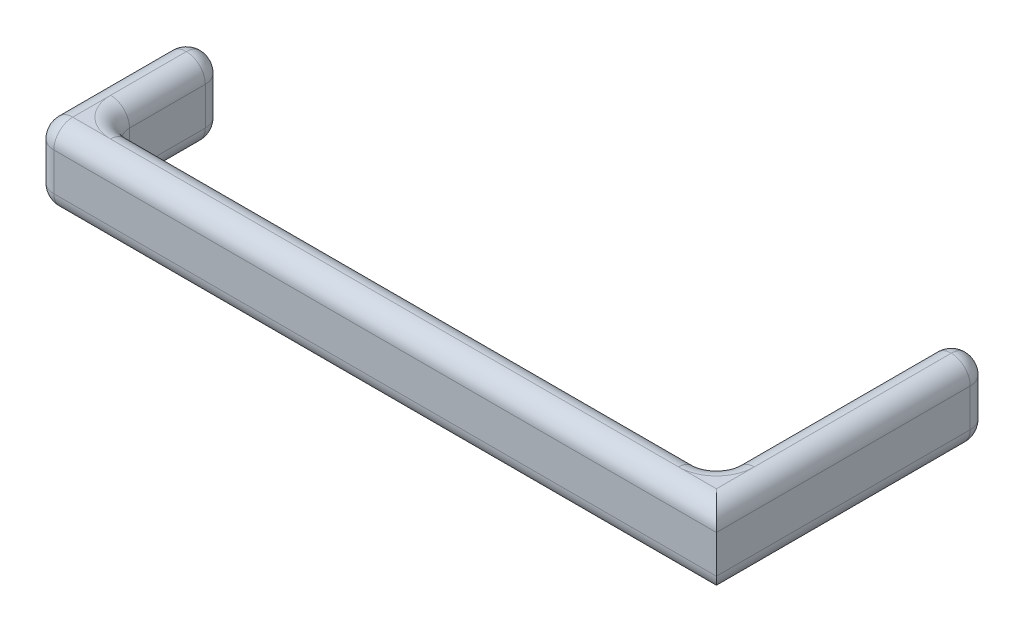
ISO-10303-21;
HEADER;
FILE_DESCRIPTION(('STEP AP214'),'2;1');
FILE_NAME('part.step','',(''),(''),'','','');
FILE_SCHEMA(('AUTOMOTIVE_DESIGN { 1 0 10303 214 1 1 1 1 }'));
ENDSEC;
DATA;
#1=APPLICATION_CONTEXT('core data for automotive mechanical design processes');
#2=APPLICATION_PROTOCOL_DEFINITION('international standard','automotive_design',2000,#1);
#3=PRODUCT_CONTEXT('',#1,'mechanical');
#4=PRODUCT('Part','Part','',(#3));
#5=PRODUCT_RELATED_PRODUCT_CATEGORY('part','',(#4));
#6=PRODUCT_DEFINITION_FORMATION('','',#4);
#7=PRODUCT_DEFINITION_CONTEXT('part definition',#1,'design');
#8=PRODUCT_DEFINITION('design','',#6,#7);
#9=PRODUCT_DEFINITION_SHAPE('','',#8);
#10=(LENGTH_UNIT() NAMED_UNIT(*) SI_UNIT(.MILLI.,.METRE.));
#11=(NAMED_UNIT(*) PLANE_ANGLE_UNIT() SI_UNIT($,.RADIAN.));
#12=(NAMED_UNIT(*) SI_UNIT($,.STERADIAN.) SOLID_ANGLE_UNIT());
#13=UNCERTAINTY_MEASURE_WITH_UNIT(LENGTH_MEASURE(1.E-05),#10,'distance_accuracy_value','');
#14=(GEOMETRIC_REPRESENTATION_CONTEXT(3) GLOBAL_UNCERTAINTY_ASSIGNED_CONTEXT((#13)) GLOBAL_UNIT_ASSIGNED_CONTEXT((#10,
#11,#12)) REPRESENTATION_CONTEXT('',''));
#15=CARTESIAN_POINT('',(0.,0.,0.));
#16=DIRECTION('',(0.,0.,1.));
#17=DIRECTION('',(1.,0.,0.));
#18=AXIS2_PLACEMENT_3D('',#15,#16,#17);
#19=CARTESIAN_POINT('',(0.,101.6,50.8));
#20=DIRECTION('',(0.,-1.,0.));
#21=DIRECTION('',(1.,0.,0.));
#22=AXIS2_PLACEMENT_3D('',#19,#20,#21);
#23=PLANE('',#22);
#24=CARTESIAN_POINT('',(-25.4,101.6,-25.4));
#25=DIRECTION('',(0.,-1.,0.));
#26=DIRECTION('',(1.,0.,0.));
#27=AXIS2_PLACEMENT_3D('',#24,#25,#26);
#28=CIRCLE('',#27,50.8);
#29=CARTESIAN_POINT('',(-25.4,101.6,25.4));
#30=VERTEX_POINT('',#29);
#31=CARTESIAN_POINT('',(25.4,101.6,-25.4));
#32=VERTEX_POINT('',#31);
#33=EDGE_CURVE('E11',#30,#32,#28,.F.);
#34=ORIENTED_EDGE('',*,*,#33,.F.);
#35=DIRECTION('',(-1.,0.,0.));
#36=VECTOR('',#35,1.);
#37=CARTESIAN_POINT('',(50.8,101.6,25.4));
#38=LINE('',#37,#36);
#39=CARTESIAN_POINT('',(25.4,101.6,25.4));
#40=VERTEX_POINT('',#39);
#41=EDGE_CURVE('E194',#30,#40,#38,.F.);
#42=ORIENTED_EDGE('',*,*,#41,.T.);
#43=DIRECTION('',(0.,0.,1.));
#44=VECTOR('',#43,1.);
#45=CARTESIAN_POINT('',(25.4,101.6,-315.087));
#46=LINE('',#45,#44);
#47=EDGE_CURVE('E48',#40,#32,#46,.F.);
#48=ORIENTED_EDGE('',*,*,#47,.T.);
#49=EDGE_LOOP('',(#34,#42,#48));
#50=FACE_BOUND('',#49,.T.);
#51=ADVANCED_FACE('F38',(#50),#23,.F.);
#52=CARTESIAN_POINT('',(-787.4,101.6,-25.4));
#53=DIRECTION('',(0.,-1.,0.));
#54=DIRECTION('',(1.,0.,0.));
#55=AXIS2_PLACEMENT_3D('',#52,#53,#54);
#56=CIRCLE('',#55,50.8);
#57=CARTESIAN_POINT('',(-838.2,101.6,-25.4));
#58=VERTEX_POINT('',#57);
#59=CARTESIAN_POINT('',(-787.4,101.6,25.4));
#60=VERTEX_POINT('',#59);
#61=EDGE_CURVE('E203',#58,#60,#56,.F.);
#62=ORIENTED_EDGE('',*,*,#61,.F.);
#63=DIRECTION('',(0.,0.,1.));
#64=VECTOR('',#63,1.);
#65=CARTESIAN_POINT('',(-838.2,101.6,50.8));
#66=LINE('',#65,#64);
#67=CARTESIAN_POINT('',(-838.2,101.6,25.4));
#68=VERTEX_POINT('',#67);
#69=EDGE_CURVE('E443',#58,#68,#66,.T.);
#70=ORIENTED_EDGE('',*,*,#69,.T.);
#71=DIRECTION('',(-1.,0.,0.));
#72=VECTOR('',#71,1.);
#73=CARTESIAN_POINT('',(50.8,101.6,25.4));
#74=LINE('',#73,#72);
#75=EDGE_CURVE('E445',#68,#60,#74,.F.);
#76=ORIENTED_EDGE('',*,*,#75,.T.);
#77=EDGE_LOOP('',(#62,#70,#76));
#78=FACE_BOUND('',#77,.T.);
#79=ADVANCED_FACE('F226',(#78),#23,.F.);
#80=CARTESIAN_POINT('',(0.,0.,50.8));
#81=DIRECTION('',(0.,1.,0.));
#82=DIRECTION('',(-1.,0.,0.));
#83=AXIS2_PLACEMENT_3D('',#80,#81,#82);
#84=PLANE('',#83);
#85=DIRECTION('',(0.,0.,1.));
#86=VECTOR('',#85,1.);
#87=CARTESIAN_POINT('',(25.4,0.,50.8));
#88=LINE('',#87,#86);
#89=CARTESIAN_POINT('',(25.4,0.,-25.4));
#90=VERTEX_POINT('',#89);
#91=CARTESIAN_POINT('',(25.4,0.,25.4));
#92=VERTEX_POINT('',#91);
#93=EDGE_CURVE('E398',#90,#92,#88,.T.);
#94=ORIENTED_EDGE('',*,*,#93,.T.);
#95=DIRECTION('',(1.,0.,0.));
#96=VECTOR('',#95,1.);
#97=CARTESIAN_POINT('',(-863.6,-1.05760497574365E-13,25.4));
#98=LINE('',#97,#96);
#99=CARTESIAN_POINT('',(-25.4,0.,25.4));
#100=VERTEX_POINT('',#99);
#101=EDGE_CURVE('E400',#92,#100,#98,.F.);
#102=ORIENTED_EDGE('',*,*,#101,.T.);
#103=CARTESIAN_POINT('',(-25.4,0.,-25.4));
#104=DIRECTION('',(0.,1.,0.));
#105=DIRECTION('',(-1.,0.,0.));
#106=AXIS2_PLACEMENT_3D('',#103,#104,#105);
#107=CIRCLE('',#106,50.8);
#108=EDGE_CURVE('E395',#90,#100,#107,.F.);
#109=ORIENTED_EDGE('',*,*,#108,.F.);
#110=EDGE_LOOP('',(#94,#102,#109));
#111=FACE_BOUND('',#110,.T.);
#112=ADVANCED_FACE('F231',(#111),#84,.F.);
#113=CARTESIAN_POINT('',(-787.4,0.,-25.4));
#114=DIRECTION('',(0.,1.,0.));
#115=DIRECTION('',(-1.,0.,0.));
#116=AXIS2_PLACEMENT_3D('',#113,#114,#115);
#117=CIRCLE('',#116,50.8);
#118=CARTESIAN_POINT('',(-787.4,0.,25.4));
#119=VERTEX_POINT('',#118);
#120=CARTESIAN_POINT('',(-838.2,-1.02649894704531E-13,-25.4));
#121=VERTEX_POINT('',#120);
#122=EDGE_CURVE('E387',#119,#121,#117,.F.);
#123=ORIENTED_EDGE('',*,*,#122,.F.);
#124=DIRECTION('',(1.,0.,0.));
#125=VECTOR('',#124,1.);
#126=CARTESIAN_POINT('',(-863.6,-1.05760497574365E-13,25.4));
#127=LINE('',#126,#125);
#128=CARTESIAN_POINT('',(-838.2,-1.02649894704531E-13,25.4));
#129=VERTEX_POINT('',#128);
#130=EDGE_CURVE('E392',#119,#129,#127,.F.);
#131=ORIENTED_EDGE('',*,*,#130,.T.);
#132=DIRECTION('',(0.,0.,1.));
#133=VECTOR('',#132,1.);
#134=CARTESIAN_POINT('',(-838.2,-1.02649894704531E-13,-152.4));
#135=LINE('',#134,#133);
#136=EDGE_CURVE('E390',#129,#121,#135,.F.);
#137=ORIENTED_EDGE('',*,*,#136,.T.);
#138=EDGE_LOOP('',(#123,#131,#137));
#139=FACE_BOUND('',#138,.T.);
#140=ADVANCED_FACE('F235',(#139),#84,.F.);
#141=CARTESIAN_POINT('',(0.,0.,50.8));
#142=DIRECTION('',(0.,0.,1.));
#143=DIRECTION('',(1.,0.,0.));
#144=AXIS2_PLACEMENT_3D('',#141,#142,#143);
#145=PLANE('',#144);
#146=DIRECTION('',(0.,-1.,0.));
#147=VECTOR('',#146,1.);
#148=CARTESIAN_POINT('',(-838.2,0.,50.8));
#149=LINE('',#148,#147);
#150=CARTESIAN_POINT('',(-838.2,76.1999999999999,50.8));
#151=VERTEX_POINT('',#150);
#152=CARTESIAN_POINT('',(-838.2,25.3999999999999,50.8));
#153=VERTEX_POINT('',#152);
#154=EDGE_CURVE('E381',#151,#153,#149,.T.);
#155=ORIENTED_EDGE('',*,*,#154,.T.);
#156=DIRECTION('',(1.,0.,0.));
#157=VECTOR('',#156,1.);
#158=CARTESIAN_POINT('',(50.8,25.4,50.8));
#159=LINE('',#158,#157);
#160=CARTESIAN_POINT('',(50.8,25.4,50.8));
#161=VERTEX_POINT('',#160);
#162=EDGE_CURVE('E385',#153,#161,#159,.T.);
#163=ORIENTED_EDGE('',*,*,#162,.T.);
#164=DIRECTION('',(0.,1.,0.));
#165=VECTOR('',#164,1.);
#166=CARTESIAN_POINT('',(50.8,101.6,50.8));
#167=LINE('',#166,#165);
#168=CARTESIAN_POINT('',(50.8,76.2,50.8));
#169=VERTEX_POINT('',#168);
#170=EDGE_CURVE('E372',#161,#169,#167,.T.);
#171=ORIENTED_EDGE('',*,*,#170,.T.);
#172=DIRECTION('',(-1.,0.,0.));
#173=VECTOR('',#172,1.);
#174=CARTESIAN_POINT('',(-863.6,76.1999999999999,50.8));
#175=LINE('',#174,#173);
#176=EDGE_CURVE('E376',#169,#151,#175,.T.);
#177=ORIENTED_EDGE('',*,*,#176,.T.);
#178=EDGE_LOOP('',(#155,#163,#171,#177));
#179=FACE_BOUND('',#178,.T.);
#180=ADVANCED_FACE('F578',(#179),#145,.T.);
#181=CARTESIAN_POINT('',(0.,0.,0.));
#182=DIRECTION('',(0.,0.,1.));
#183=DIRECTION('',(1.,0.,0.));
#184=AXIS2_PLACEMENT_3D('',#181,#182,#183);
#185=PLANE('',#184);
#186=DIRECTION('',(0.,1.,0.));
#187=VECTOR('',#186,1.);
#188=CARTESIAN_POINT('',(-25.4,0.,0.));
#189=LINE('',#188,#187);
#190=CARTESIAN_POINT('',(-25.4,76.2,0.));
#191=VERTEX_POINT('',#190);
#192=CARTESIAN_POINT('',(-25.4,25.4,0.));
#193=VERTEX_POINT('',#192);
#194=EDGE_CURVE('E413',#191,#193,#189,.F.);
#195=ORIENTED_EDGE('',*,*,#194,.T.);
#196=DIRECTION('',(1.,0.,0.));
#197=VECTOR('',#196,1.);
#198=CARTESIAN_POINT('',(0.,25.4,0.));
#199=LINE('',#198,#197);
#200=CARTESIAN_POINT('',(-787.4,25.3999999999999,0.));
#201=VERTEX_POINT('',#200);
#202=EDGE_CURVE('E415',#193,#201,#199,.F.);
#203=ORIENTED_EDGE('',*,*,#202,.T.);
#204=DIRECTION('',(0.,-1.,0.));
#205=VECTOR('',#204,1.);
#206=CARTESIAN_POINT('',(-787.4,0.,0.));
#207=LINE('',#206,#205);
#208=CARTESIAN_POINT('',(-787.4,76.1999999999999,0.));
#209=VERTEX_POINT('',#208);
#210=EDGE_CURVE('E411',#201,#209,#207,.F.);
#211=ORIENTED_EDGE('',*,*,#210,.T.);
#212=DIRECTION('',(-1.,0.,0.));
#213=VECTOR('',#212,1.);
#214=CARTESIAN_POINT('',(0.,76.2,0.));
#215=LINE('',#214,#213);
#216=EDGE_CURVE('E409',#209,#191,#215,.F.);
#217=ORIENTED_EDGE('',*,*,#216,.T.);
#218=EDGE_LOOP('',(#195,#203,#211,#217));
#219=FACE_BOUND('',#218,.T.);
#220=ADVANCED_FACE('F603',(#219),#185,.F.);
#221=CARTESIAN_POINT('',(-812.8,0.,-152.4));
#222=DIRECTION('',(1.,0.,0.));
#223=DIRECTION('',(0.,0.,-1.));
#224=AXIS2_PLACEMENT_3D('',#221,#222,#223);
#225=PLANE('',#224);
#226=DIRECTION('',(0.,0.,1.));
#227=VECTOR('',#226,1.);
#228=CARTESIAN_POINT('',(-812.8,25.3999999999999,-152.4));
#229=LINE('',#228,#227);
#230=CARTESIAN_POINT('',(-812.8,25.3999999999999,-25.4));
#231=VERTEX_POINT('',#230);
#232=CARTESIAN_POINT('',(-812.8,25.3999999999999,-127.));
#233=VERTEX_POINT('',#232);
#234=EDGE_CURVE('E439',#231,#233,#229,.F.);
#235=ORIENTED_EDGE('',*,*,#234,.T.);
#236=DIRECTION('',(0.,1.,0.));
#237=VECTOR('',#236,1.);
#238=CARTESIAN_POINT('',(-812.8,101.6,-127.));
#239=LINE('',#238,#237);
#240=CARTESIAN_POINT('',(-812.8,76.1999999999999,-127.));
#241=VERTEX_POINT('',#240);
#242=EDGE_CURVE('E441',#233,#241,#239,.T.);
#243=ORIENTED_EDGE('',*,*,#242,.T.);
#244=DIRECTION('',(0.,0.,1.));
#245=VECTOR('',#244,1.);
#246=CARTESIAN_POINT('',(-812.8,76.1999999999999,0.));
#247=LINE('',#246,#245);
#248=CARTESIAN_POINT('',(-812.8,76.1999999999999,-25.4));
#249=VERTEX_POINT('',#248);
#250=EDGE_CURVE('E435',#241,#249,#247,.T.);
#251=ORIENTED_EDGE('',*,*,#250,.T.);
#252=DIRECTION('',(0.,-1.,0.));
#253=VECTOR('',#252,1.);
#254=CARTESIAN_POINT('',(-812.8,0.,-25.4));
#255=LINE('',#254,#253);
#256=EDGE_CURVE('E437',#249,#231,#255,.T.);
#257=ORIENTED_EDGE('',*,*,#256,.T.);
#258=EDGE_LOOP('',(#235,#243,#251,#257));
#259=FACE_BOUND('',#258,.T.);
#260=ADVANCED_FACE('F560',(#259),#225,.T.);
#261=CARTESIAN_POINT('',(-863.6,0.,-152.4));
#262=DIRECTION('',(-1.,0.,0.));
#263=DIRECTION('',(0.,0.,1.));
#264=AXIS2_PLACEMENT_3D('',#261,#262,#263);
#265=PLANE('',#264);
#266=DIRECTION('',(0.,-1.,0.));
#267=VECTOR('',#266,1.);
#268=CARTESIAN_POINT('',(-863.6,0.,-127.));
#269=LINE('',#268,#267);
#270=CARTESIAN_POINT('',(-863.6,76.1999999999999,-127.));
#271=VERTEX_POINT('',#270);
#272=CARTESIAN_POINT('',(-863.6,25.3999999999999,-127.));
#273=VERTEX_POINT('',#272);
#274=EDGE_CURVE('E420',#271,#273,#269,.T.);
#275=ORIENTED_EDGE('',*,*,#274,.T.);
#276=DIRECTION('',(0.,0.,1.));
#277=VECTOR('',#276,1.);
#278=CARTESIAN_POINT('',(-863.6,25.3999999999999,50.8));
#279=LINE('',#278,#277);
#280=CARTESIAN_POINT('',(-863.6,25.3999999999999,25.4));
#281=VERTEX_POINT('',#280);
#282=EDGE_CURVE('E424',#273,#281,#279,.T.);
#283=ORIENTED_EDGE('',*,*,#282,.T.);
#284=DIRECTION('',(0.,-1.,0.));
#285=VECTOR('',#284,1.);
#286=CARTESIAN_POINT('',(-863.6,0.,25.4));
#287=LINE('',#286,#285);
#288=CARTESIAN_POINT('',(-863.6,76.1999999999999,25.4));
#289=VERTEX_POINT('',#288);
#290=EDGE_CURVE('E422',#281,#289,#287,.F.);
#291=ORIENTED_EDGE('',*,*,#290,.T.);
#292=DIRECTION('',(0.,0.,1.));
#293=VECTOR('',#292,1.);
#294=CARTESIAN_POINT('',(-863.6,76.1999999999999,-152.4));
#295=LINE('',#294,#293);
#296=EDGE_CURVE('E418',#289,#271,#295,.F.);
#297=ORIENTED_EDGE('',*,*,#296,.T.);
#298=EDGE_LOOP('',(#275,#283,#291,#297));
#299=FACE_BOUND('',#298,.T.);
#300=ADVANCED_FACE('F609',(#299),#265,.T.);
#301=CARTESIAN_POINT('',(0.,101.6,-152.4));
#302=DIRECTION('',(-1.,0.,0.));
#303=DIRECTION('',(0.,0.,1.));
#304=AXIS2_PLACEMENT_3D('',#301,#302,#303);
#305=PLANE('',#304);
#306=DIRECTION('',(0.,1.,0.));
#307=VECTOR('',#306,1.);
#308=CARTESIAN_POINT('',(0.,101.6,-289.687));
#309=LINE('',#308,#307);
#310=CARTESIAN_POINT('',(0.,76.2,-289.687));
#311=VERTEX_POINT('',#310);
#312=CARTESIAN_POINT('',(0.,25.4,-289.687));
#313=VERTEX_POINT('',#312);
#314=EDGE_CURVE('E430',#311,#313,#309,.F.);
#315=ORIENTED_EDGE('',*,*,#314,.T.);
#316=DIRECTION('',(0.,0.,1.));
#317=VECTOR('',#316,1.);
#318=CARTESIAN_POINT('',(0.,25.4,0.));
#319=LINE('',#318,#317);
#320=CARTESIAN_POINT('',(0.,25.4,-25.4));
#321=VERTEX_POINT('',#320);
#322=EDGE_CURVE('E433',#313,#321,#319,.T.);
#323=ORIENTED_EDGE('',*,*,#322,.T.);
#324=DIRECTION('',(0.,1.,0.));
#325=VECTOR('',#324,1.);
#326=CARTESIAN_POINT('',(0.,101.6,-25.4));
#327=LINE('',#326,#325);
#328=CARTESIAN_POINT('',(0.,76.2,-25.4));
#329=VERTEX_POINT('',#328);
#330=EDGE_CURVE('E428',#321,#329,#327,.T.);
#331=ORIENTED_EDGE('',*,*,#330,.T.);
#332=DIRECTION('',(0.,0.,1.));
#333=VECTOR('',#332,1.);
#334=CARTESIAN_POINT('',(0.,76.2,-315.087));
#335=LINE('',#334,#333);
#336=EDGE_CURVE('E358',#329,#311,#335,.F.);
#337=ORIENTED_EDGE('',*,*,#336,.T.);
#338=EDGE_LOOP('',(#315,#323,#331,#337));
#339=FACE_BOUND('',#338,.T.);
#340=ADVANCED_FACE('F596',(#339),#305,.T.);
#341=CARTESIAN_POINT('',(50.8,101.6,-152.4));
#342=DIRECTION('',(1.,0.,0.));
#343=DIRECTION('',(0.,1.,0.));
#344=AXIS2_PLACEMENT_3D('',#341,#342,#343);
#345=PLANE('',#344);
#346=ORIENTED_EDGE('',*,*,#170,.F.);
#347=DIRECTION('',(0.,0.,1.));
#348=VECTOR('',#347,1.);
#349=CARTESIAN_POINT('',(50.8,25.4,-315.087));
#350=LINE('',#349,#348);
#351=CARTESIAN_POINT('',(50.8,25.4,-289.687));
#352=VERTEX_POINT('',#351);
#353=EDGE_CURVE('E407',#161,#352,#350,.F.);
#354=ORIENTED_EDGE('',*,*,#353,.T.);
#355=DIRECTION('',(0.,1.,0.));
#356=VECTOR('',#355,1.);
#357=CARTESIAN_POINT('',(50.8,101.6,-289.687));
#358=LINE('',#357,#356);
#359=CARTESIAN_POINT('',(50.8,76.2,-289.687));
#360=VERTEX_POINT('',#359);
#361=EDGE_CURVE('E405',#352,#360,#358,.T.);
#362=ORIENTED_EDGE('',*,*,#361,.T.);
#363=DIRECTION('',(0.,0.,1.));
#364=VECTOR('',#363,1.);
#365=CARTESIAN_POINT('',(50.8,76.2,50.8));
#366=LINE('',#365,#364);
#367=EDGE_CURVE('E403',#360,#169,#366,.T.);
#368=ORIENTED_EDGE('',*,*,#367,.T.);
#369=EDGE_LOOP('',(#346,#354,#362,#368));
#370=FACE_BOUND('',#369,.T.);
#371=ADVANCED_FACE('F580',(#370),#345,.T.);
#372=CARTESIAN_POINT('',(-838.2,76.1999999999999,-127.));
#373=DIRECTION('',(0.,0.,1.));
#374=DIRECTION('',(1.,0.,0.));
#375=AXIS2_PLACEMENT_3D('',#372,#373,#374);
#376=SPHERICAL_SURFACE('',#375,25.4);
#377=CARTESIAN_POINT('',(-838.2,76.1999999999999,-127.));
#378=DIRECTION('',(0.,0.,-1.));
#379=DIRECTION('',(-1.,0.,0.));
#380=AXIS2_PLACEMENT_3D('',#377,#378,#379);
#381=CIRCLE('',#380,25.4);
#382=CARTESIAN_POINT('',(-838.2,101.6,-127.));
#383=VERTEX_POINT('',#382);
#384=EDGE_CURVE('E366',#241,#383,#381,.F.);
#385=ORIENTED_EDGE('',*,*,#384,.F.);
#386=CARTESIAN_POINT('',(-838.2,76.1999999999999,-127.));
#387=DIRECTION('',(0.,1.,0.));
#388=DIRECTION('',(0.,0.,1.));
#389=AXIS2_PLACEMENT_3D('',#386,#387,#388);
#390=CIRCLE('',#389,25.4);
#391=CARTESIAN_POINT('',(-838.2,76.1999999999999,-152.4));
#392=VERTEX_POINT('',#391);
#393=EDGE_CURVE('E42',#392,#241,#390,.F.);
#394=ORIENTED_EDGE('',*,*,#393,.F.);
#395=CARTESIAN_POINT('',(-838.2,76.1999999999999,-127.));
#396=DIRECTION('',(-1.,0.,0.));
#397=DIRECTION('',(0.,0.,1.));
#398=AXIS2_PLACEMENT_3D('',#395,#396,#397);
#399=CIRCLE('',#398,25.4);
#400=EDGE_CURVE('E368',#383,#392,#399,.T.);
#401=ORIENTED_EDGE('',*,*,#400,.F.);
#402=EDGE_LOOP('',(#385,#394,#401));
#403=FACE_BOUND('',#402,.T.);
#404=ADVANCED_FACE('F40',(#403),#376,.T.);
#405=CARTESIAN_POINT('',(-838.2,0.,-127.));
#406=DIRECTION('',(0.,-1.,0.));
#407=DIRECTION('',(0.,0.,-1.));
#408=AXIS2_PLACEMENT_3D('',#405,#406,#407);
#409=CYLINDRICAL_SURFACE('',#408,25.4);
#410=ORIENTED_EDGE('',*,*,#393,.T.);
#411=ORIENTED_EDGE('',*,*,#242,.F.);
#412=CARTESIAN_POINT('',(-838.2,25.3999999999999,-127.));
#413=DIRECTION('',(0.,-1.,0.));
#414=DIRECTION('',(1.,0.,0.));
#415=AXIS2_PLACEMENT_3D('',#412,#413,#414);
#416=CIRCLE('',#415,25.4);
#417=CARTESIAN_POINT('',(-838.2,25.3999999999999,-152.4));
#418=VERTEX_POINT('',#417);
#419=EDGE_CURVE('E548',#418,#233,#416,.T.);
#420=ORIENTED_EDGE('',*,*,#419,.F.);
#421=DIRECTION('',(0.,1.,0.));
#422=VECTOR('',#421,1.);
#423=CARTESIAN_POINT('',(-838.2,0.,-152.4));
#424=LINE('',#423,#422);
#425=EDGE_CURVE('E542',#392,#418,#424,.F.);
#426=ORIENTED_EDGE('',*,*,#425,.F.);
#427=EDGE_LOOP('',(#410,#411,#420,#426));
#428=FACE_BOUND('',#427,.T.);
#429=ADVANCED_FACE('F350',(#428),#409,.T.);
#430=CARTESIAN_POINT('',(-838.2,76.1999999999999,-127.));
#431=DIRECTION('',(0.,0.,1.));
#432=DIRECTION('',(1.,0.,0.));
#433=AXIS2_PLACEMENT_3D('',#430,#431,#432);
#434=SPHERICAL_SURFACE('',#433,25.4);
#435=CARTESIAN_POINT('',(-838.2,76.1999999999999,-127.));
#436=DIRECTION('',(0.,0.,-1.));
#437=DIRECTION('',(0.,1.,0.));
#438=AXIS2_PLACEMENT_3D('',#435,#436,#437);
#439=CIRCLE('',#438,25.4);
#440=EDGE_CURVE('E536',#383,#271,#439,.F.);
#441=ORIENTED_EDGE('',*,*,#440,.F.);
#442=ORIENTED_EDGE('',*,*,#400,.T.);
#443=CARTESIAN_POINT('',(-838.2,76.1999999999999,-127.));
#444=DIRECTION('',(0.,1.,0.));
#445=DIRECTION('',(0.,0.,1.));
#446=AXIS2_PLACEMENT_3D('',#443,#444,#445);
#447=CIRCLE('',#446,25.4);
#448=EDGE_CURVE('E539',#271,#392,#447,.F.);
#449=ORIENTED_EDGE('',*,*,#448,.F.);
#450=EDGE_LOOP('',(#441,#442,#449));
#451=FACE_BOUND('',#450,.T.);
#452=ADVANCED_FACE('F346',(#451),#434,.T.);
#453=CARTESIAN_POINT('',(-838.2,76.1999999999999,-152.4));
#454=DIRECTION('',(0.,0.,-1.));
#455=DIRECTION('',(-1.,0.,0.));
#456=AXIS2_PLACEMENT_3D('',#453,#454,#455);
#457=CYLINDRICAL_SURFACE('',#456,25.4);
#458=DIRECTION('',(0.,0.,1.));
#459=VECTOR('',#458,1.);
#460=CARTESIAN_POINT('',(-838.2,101.6,-152.4));
#461=LINE('',#460,#459);
#462=EDGE_CURVE('E215',#58,#383,#461,.F.);
#463=ORIENTED_EDGE('',*,*,#462,.F.);
#464=CARTESIAN_POINT('',(-838.2,76.1999999999999,-25.4));
#465=DIRECTION('',(0.,0.,1.));
#466=DIRECTION('',(1.,0.,0.));
#467=AXIS2_PLACEMENT_3D('',#464,#465,#466);
#468=CIRCLE('',#467,25.4);
#469=EDGE_CURVE('E551',#249,#58,#468,.T.);
#470=ORIENTED_EDGE('',*,*,#469,.F.);
#471=ORIENTED_EDGE('',*,*,#250,.F.);
#472=ORIENTED_EDGE('',*,*,#384,.T.);
#473=EDGE_LOOP('',(#463,#470,#471,#472));
#474=FACE_BOUND('',#473,.T.);
#475=ADVANCED_FACE('F343',(#474),#457,.T.);
#476=CARTESIAN_POINT('',(25.4,76.2,50.8));
#477=DIRECTION('',(0.,0.,-1.));
#478=DIRECTION('',(-1.,0.,0.));
#479=AXIS2_PLACEMENT_3D('',#476,#477,#478);
#480=CYLINDRICAL_SURFACE('',#479,25.4);
#481=CARTESIAN_POINT('',(25.4,76.2,-25.4));
#482=DIRECTION('',(0.,0.,1.));
#483=DIRECTION('',(1.,0.,0.));
#484=AXIS2_PLACEMENT_3D('',#481,#482,#483);
#485=CIRCLE('',#484,25.4);
#486=EDGE_CURVE('E223',#32,#329,#485,.T.);
#487=ORIENTED_EDGE('',*,*,#486,.F.);
#488=DIRECTION('',(0.,0.,1.));
#489=VECTOR('',#488,1.);
#490=CARTESIAN_POINT('',(25.4,101.6,0.));
#491=LINE('',#490,#489);
#492=CARTESIAN_POINT('',(25.4,101.6,-289.687));
#493=VERTEX_POINT('',#492);
#494=EDGE_CURVE('E90',#493,#32,#491,.T.);
#495=ORIENTED_EDGE('',*,*,#494,.F.);
#496=CARTESIAN_POINT('',(25.4,76.2,-289.687));
#497=DIRECTION('',(0.,0.,-1.));
#498=DIRECTION('',(-1.,0.,0.));
#499=AXIS2_PLACEMENT_3D('',#496,#497,#498);
#500=CIRCLE('',#499,25.4);
#501=EDGE_CURVE('E359',#311,#493,#500,.T.);
#502=ORIENTED_EDGE('',*,*,#501,.F.);
#503=ORIENTED_EDGE('',*,*,#336,.F.);
#504=EDGE_LOOP('',(#487,#495,#502,#503));
#505=FACE_BOUND('',#504,.T.);
#506=ADVANCED_FACE('F342',(#505),#480,.T.);
#507=CARTESIAN_POINT('',(0.,76.2,25.4));
#508=DIRECTION('',(-1.,0.,0.));
#509=DIRECTION('',(0.,-1.,0.));
#510=AXIS2_PLACEMENT_3D('',#507,#508,#509);
#511=CYLINDRICAL_SURFACE('',#510,25.4);
#512=DIRECTION('',(-1.,0.,0.));
#513=VECTOR('',#512,1.);
#514=CARTESIAN_POINT('',(0.,101.6,25.4));
#515=LINE('',#514,#513);
#516=EDGE_CURVE('E198',#30,#60,#515,.T.);
#517=ORIENTED_EDGE('',*,*,#516,.F.);
#518=CARTESIAN_POINT('',(-25.4,76.2,25.4));
#519=DIRECTION('',(1.,0.,0.));
#520=DIRECTION('',(0.,1.,0.));
#521=AXIS2_PLACEMENT_3D('',#518,#519,#520);
#522=CIRCLE('',#521,25.4);
#523=EDGE_CURVE('E210',#191,#30,#522,.T.);
#524=ORIENTED_EDGE('',*,*,#523,.F.);
#525=ORIENTED_EDGE('',*,*,#216,.F.);
#526=CARTESIAN_POINT('',(-787.4,76.1999999999999,25.4));
#527=DIRECTION('',(-1.,0.,0.));
#528=DIRECTION('',(0.,0.,1.));
#529=AXIS2_PLACEMENT_3D('',#526,#527,#528);
#530=CIRCLE('',#529,25.4);
#531=EDGE_CURVE('E213',#60,#209,#530,.T.);
#532=ORIENTED_EDGE('',*,*,#531,.F.);
#533=EDGE_LOOP('',(#517,#524,#525,#532));
#534=FACE_BOUND('',#533,.T.);
#535=ADVANCED_FACE('F208',(#534),#511,.T.);
#536=CARTESIAN_POINT('',(25.4,76.2,-152.4));
#537=DIRECTION('',(0.,0.,-1.));
#538=DIRECTION('',(-1.,0.,0.));
#539=AXIS2_PLACEMENT_3D('',#536,#537,#538);
#540=CYLINDRICAL_SURFACE('',#539,25.4);
#541=CARTESIAN_POINT('',(25.4,76.2,-289.687));
#542=DIRECTION('',(0.,0.,-1.));
#543=DIRECTION('',(-1.,0.,0.));
#544=AXIS2_PLACEMENT_3D('',#541,#542,#543);
#545=CIRCLE('',#544,25.4);
#546=EDGE_CURVE('E530',#493,#360,#545,.T.);
#547=ORIENTED_EDGE('',*,*,#546,.F.);
#548=ORIENTED_EDGE('',*,*,#494,.T.);
#549=ORIENTED_EDGE('',*,*,#47,.F.);
#550=CARTESIAN_POINT('',(25.4,76.2,25.4));
#551=DIRECTION('',(0.707106781186547,0.,-0.707106781186547));
#552=DIRECTION('',(0.707106781186547,0.,0.707106781186547));
#553=AXIS2_PLACEMENT_3D('',#550,#551,#552);
#554=ELLIPSE('',#553,35.9210244842766,25.4);
#555=EDGE_CURVE('E202',#169,#40,#554,.F.);
#556=ORIENTED_EDGE('',*,*,#555,.F.);
#557=ORIENTED_EDGE('',*,*,#367,.F.);
#558=EDGE_LOOP('',(#547,#548,#549,#556,#557));
#559=FACE_BOUND('',#558,.T.);
#560=ADVANCED_FACE('F335',(#559),#540,.T.);
#561=CARTESIAN_POINT('',(25.4,76.2,-289.687));
#562=DIRECTION('',(0.,0.,1.));
#563=DIRECTION('',(1.,0.,0.));
#564=AXIS2_PLACEMENT_3D('',#561,#562,#563);
#565=SPHERICAL_SURFACE('',#564,25.4);
#566=ORIENTED_EDGE('',*,*,#501,.T.);
#567=CARTESIAN_POINT('',(25.4,76.2,-289.687));
#568=DIRECTION('',(1.,0.,0.));
#569=DIRECTION('',(0.,1.,0.));
#570=AXIS2_PLACEMENT_3D('',#567,#568,#569);
#571=CIRCLE('',#570,25.4);
#572=CARTESIAN_POINT('',(25.4,76.2,-315.087));
#573=VERTEX_POINT('',#572);
#574=EDGE_CURVE('E528',#573,#493,#571,.T.);
#575=ORIENTED_EDGE('',*,*,#574,.F.);
#576=CARTESIAN_POINT('',(25.4,76.2,-289.687));
#577=DIRECTION('',(0.,1.,0.));
#578=DIRECTION('',(0.,0.,1.));
#579=AXIS2_PLACEMENT_3D('',#576,#577,#578);
#580=CIRCLE('',#579,25.4);
#581=EDGE_CURVE('E525',#311,#573,#580,.F.);
#582=ORIENTED_EDGE('',*,*,#581,.F.);
#583=EDGE_LOOP('',(#566,#575,#582));
#584=FACE_BOUND('',#583,.T.);
#585=ADVANCED_FACE('F332',(#584),#565,.T.);
#586=CARTESIAN_POINT('',(-25.4,76.2,-25.4));
#587=DIRECTION('',(0.,-1.,0.));
#588=DIRECTION('',(1.,0.,0.));
#589=AXIS2_PLACEMENT_3D('',#586,#587,#588);
#590=TOROIDAL_SURFACE('',#589,50.8,25.4);
#591=ORIENTED_EDGE('',*,*,#33,.T.);
#592=ORIENTED_EDGE('',*,*,#486,.T.);
#593=CARTESIAN_POINT('',(-25.4,76.2,-25.4));
#594=DIRECTION('',(0.,-1.,0.));
#595=DIRECTION('',(1.,0.,0.));
#596=AXIS2_PLACEMENT_3D('',#593,#594,#595);
#597=CIRCLE('',#596,25.4);
#598=EDGE_CURVE('E221',#191,#329,#597,.F.);
#599=ORIENTED_EDGE('',*,*,#598,.F.);
#600=ORIENTED_EDGE('',*,*,#523,.T.);
#601=EDGE_LOOP('',(#591,#592,#599,#600));
#602=FACE_BOUND('',#601,.T.);
#603=ADVANCED_FACE('F218',(#602),#590,.T.);
#604=CARTESIAN_POINT('',(-787.4,76.1999999999999,-25.4));
#605=DIRECTION('',(0.,-1.,0.));
#606=DIRECTION('',(1.,0.,0.));
#607=AXIS2_PLACEMENT_3D('',#604,#605,#606);
#608=TOROIDAL_SURFACE('',#607,50.8,25.4);
#609=ORIENTED_EDGE('',*,*,#61,.T.);
#610=ORIENTED_EDGE('',*,*,#531,.T.);
#611=CARTESIAN_POINT('',(-787.4,76.1999999999999,-25.4));
#612=DIRECTION('',(0.,-1.,0.));
#613=DIRECTION('',(1.,0.,0.));
#614=AXIS2_PLACEMENT_3D('',#611,#612,#613);
#615=CIRCLE('',#614,25.4);
#616=EDGE_CURVE('E521',#249,#209,#615,.F.);
#617=ORIENTED_EDGE('',*,*,#616,.F.);
#618=ORIENTED_EDGE('',*,*,#469,.T.);
#619=EDGE_LOOP('',(#609,#610,#617,#618));
#620=FACE_BOUND('',#619,.T.);
#621=ADVANCED_FACE('F325',(#620),#608,.T.);
#622=CARTESIAN_POINT('',(-838.2,25.3999999999999,-127.));
#623=DIRECTION('',(0.,0.,1.));
#624=DIRECTION('',(1.,0.,0.));
#625=AXIS2_PLACEMENT_3D('',#622,#623,#624);
#626=SPHERICAL_SURFACE('',#625,25.4);
#627=CARTESIAN_POINT('',(-838.2,25.3999999999999,-127.));
#628=DIRECTION('',(1.,0.,0.));
#629=DIRECTION('',(0.,0.,-1.));
#630=AXIS2_PLACEMENT_3D('',#627,#628,#629);
#631=CIRCLE('',#630,25.4);
#632=CARTESIAN_POINT('',(-838.2,-1.02649894704531E-13,-127.));
#633=VERTEX_POINT('',#632);
#634=EDGE_CURVE('E545',#418,#633,#631,.F.);
#635=ORIENTED_EDGE('',*,*,#634,.F.);
#636=ORIENTED_EDGE('',*,*,#419,.T.);
#637=CARTESIAN_POINT('',(-838.2,25.3999999999999,-127.));
#638=DIRECTION('',(0.,0.,-1.));
#639=DIRECTION('',(0.,1.,0.));
#640=AXIS2_PLACEMENT_3D('',#637,#638,#639);
#641=CIRCLE('',#640,25.4);
#642=EDGE_CURVE('E518',#633,#233,#641,.F.);
#643=ORIENTED_EDGE('',*,*,#642,.F.);
#644=EDGE_LOOP('',(#635,#636,#643));
#645=FACE_BOUND('',#644,.T.);
#646=ADVANCED_FACE('F321',(#645),#626,.T.);
#647=CARTESIAN_POINT('',(-838.2,0.,-127.));
#648=DIRECTION('',(0.,1.,0.));
#649=DIRECTION('',(0.,0.,1.));
#650=AXIS2_PLACEMENT_3D('',#647,#648,#649);
#651=CYLINDRICAL_SURFACE('',#650,25.4);
#652=ORIENTED_EDGE('',*,*,#448,.T.);
#653=ORIENTED_EDGE('',*,*,#425,.T.);
#654=CARTESIAN_POINT('',(-838.2,25.3999999999999,-127.));
#655=DIRECTION('',(0.,-1.,0.));
#656=DIRECTION('',(0.,0.,-1.));
#657=AXIS2_PLACEMENT_3D('',#654,#655,#656);
#658=CIRCLE('',#657,25.4);
#659=EDGE_CURVE('E515',#273,#418,#658,.T.);
#660=ORIENTED_EDGE('',*,*,#659,.F.);
#661=ORIENTED_EDGE('',*,*,#274,.F.);
#662=EDGE_LOOP('',(#652,#653,#660,#661));
#663=FACE_BOUND('',#662,.T.);
#664=ADVANCED_FACE('F317',(#663),#651,.T.);
#665=CARTESIAN_POINT('',(-838.2,76.1999999999999,50.8));
#666=DIRECTION('',(0.,0.,-1.));
#667=DIRECTION('',(-1.,0.,0.));
#668=AXIS2_PLACEMENT_3D('',#665,#666,#667);
#669=CYLINDRICAL_SURFACE('',#668,25.4);
#670=ORIENTED_EDGE('',*,*,#440,.T.);
#671=ORIENTED_EDGE('',*,*,#296,.F.);
#672=CARTESIAN_POINT('',(-838.2,76.1999999999999,25.4));
#673=DIRECTION('',(0.,0.,1.));
#674=DIRECTION('',(1.,0.,0.));
#675=AXIS2_PLACEMENT_3D('',#672,#673,#674);
#676=CIRCLE('',#675,25.4);
#677=EDGE_CURVE('E512',#68,#289,#676,.T.);
#678=ORIENTED_EDGE('',*,*,#677,.F.);
#679=ORIENTED_EDGE('',*,*,#69,.F.);
#680=ORIENTED_EDGE('',*,*,#462,.T.);
#681=EDGE_LOOP('',(#670,#671,#678,#679,#680));
#682=FACE_BOUND('',#681,.T.);
#683=ADVANCED_FACE('F314',(#682),#669,.T.);
#684=CARTESIAN_POINT('',(0.,76.2,25.4));
#685=DIRECTION('',(1.,0.,0.));
#686=DIRECTION('',(0.,1.,0.));
#687=AXIS2_PLACEMENT_3D('',#684,#685,#686);
#688=CYLINDRICAL_SURFACE('',#687,25.4);
#689=ORIENTED_EDGE('',*,*,#516,.T.);
#690=ORIENTED_EDGE('',*,*,#75,.F.);
#691=CARTESIAN_POINT('',(-838.2,76.1999999999999,25.4));
#692=DIRECTION('',(-1.,0.,0.));
#693=DIRECTION('',(0.,0.,1.));
#694=AXIS2_PLACEMENT_3D('',#691,#692,#693);
#695=CIRCLE('',#694,25.4);
#696=EDGE_CURVE('E509',#151,#68,#695,.T.);
#697=ORIENTED_EDGE('',*,*,#696,.F.);
#698=ORIENTED_EDGE('',*,*,#176,.F.);
#699=ORIENTED_EDGE('',*,*,#555,.T.);
#700=ORIENTED_EDGE('',*,*,#41,.F.);
#701=EDGE_LOOP('',(#689,#690,#697,#698,#699,#700));
#702=FACE_BOUND('',#701,.T.);
#703=ADVANCED_FACE('F196',(#702),#688,.T.);
#704=CARTESIAN_POINT('',(25.4,76.2,-289.687));
#705=DIRECTION('',(0.,0.,1.));
#706=DIRECTION('',(1.,0.,0.));
#707=AXIS2_PLACEMENT_3D('',#704,#705,#706);
#708=SPHERICAL_SURFACE('',#707,25.4);
#709=ORIENTED_EDGE('',*,*,#574,.T.);
#710=ORIENTED_EDGE('',*,*,#546,.T.);
#711=CARTESIAN_POINT('',(25.4,76.2,-289.687));
#712=DIRECTION('',(0.,1.,0.));
#713=DIRECTION('',(0.,0.,1.));
#714=AXIS2_PLACEMENT_3D('',#711,#712,#713);
#715=CIRCLE('',#714,25.4);
#716=EDGE_CURVE('E506',#573,#360,#715,.F.);
#717=ORIENTED_EDGE('',*,*,#716,.F.);
#718=EDGE_LOOP('',(#709,#710,#717));
#719=FACE_BOUND('',#718,.T.);
#720=ADVANCED_FACE('F307',(#719),#708,.T.);
#721=CARTESIAN_POINT('',(25.4,101.6,-289.687));
#722=DIRECTION('',(0.,1.,0.));
#723=DIRECTION('',(0.,0.,1.));
#724=AXIS2_PLACEMENT_3D('',#721,#722,#723);
#725=CYLINDRICAL_SURFACE('',#724,25.4);
#726=ORIENTED_EDGE('',*,*,#314,.F.);
#727=ORIENTED_EDGE('',*,*,#581,.T.);
#728=DIRECTION('',(0.,1.,0.));
#729=VECTOR('',#728,1.);
#730=CARTESIAN_POINT('',(25.4,101.6,-315.087));
#731=LINE('',#730,#729);
#732=CARTESIAN_POINT('',(25.4,25.4,-315.087));
#733=VERTEX_POINT('',#732);
#734=EDGE_CURVE('E503',#733,#573,#731,.T.);
#735=ORIENTED_EDGE('',*,*,#734,.F.);
#736=CARTESIAN_POINT('',(25.4,25.4,-289.687));
#737=DIRECTION('',(0.,-1.,0.));
#738=DIRECTION('',(0.,0.,-1.));
#739=AXIS2_PLACEMENT_3D('',#736,#737,#738);
#740=CIRCLE('',#739,25.4);
#741=EDGE_CURVE('E500',#313,#733,#740,.T.);
#742=ORIENTED_EDGE('',*,*,#741,.F.);
#743=EDGE_LOOP('',(#726,#727,#735,#742));
#744=FACE_BOUND('',#743,.T.);
#745=ADVANCED_FACE('F303',(#744),#725,.T.);
#746=CARTESIAN_POINT('',(-25.4,101.6,-25.4));
#747=DIRECTION('',(0.,1.,0.));
#748=DIRECTION('',(0.,0.,1.));
#749=AXIS2_PLACEMENT_3D('',#746,#747,#748);
#750=CYLINDRICAL_SURFACE('',#749,25.4);
#751=ORIENTED_EDGE('',*,*,#598,.T.);
#752=ORIENTED_EDGE('',*,*,#330,.F.);
#753=CARTESIAN_POINT('',(-25.4,25.4,-25.4));
#754=DIRECTION('',(0.,1.,0.));
#755=DIRECTION('',(-1.,0.,0.));
#756=AXIS2_PLACEMENT_3D('',#753,#754,#755);
#757=CIRCLE('',#756,25.4);
#758=EDGE_CURVE('E497',#193,#321,#757,.T.);
#759=ORIENTED_EDGE('',*,*,#758,.F.);
#760=ORIENTED_EDGE('',*,*,#194,.F.);
#761=EDGE_LOOP('',(#751,#752,#759,#760));
#762=FACE_BOUND('',#761,.T.);
#763=ADVANCED_FACE('F299',(#762),#750,.F.);
#764=CARTESIAN_POINT('',(-787.4,0.,-25.4));
#765=DIRECTION('',(0.,-1.,0.));
#766=DIRECTION('',(0.,0.,-1.));
#767=AXIS2_PLACEMENT_3D('',#764,#765,#766);
#768=CYLINDRICAL_SURFACE('',#767,25.4);
#769=ORIENTED_EDGE('',*,*,#616,.T.);
#770=ORIENTED_EDGE('',*,*,#210,.F.);
#771=CARTESIAN_POINT('',(-787.4,25.3999999999999,-25.4));
#772=DIRECTION('',(0.,1.,0.));
#773=DIRECTION('',(-1.,0.,0.));
#774=AXIS2_PLACEMENT_3D('',#771,#772,#773);
#775=CIRCLE('',#774,25.4);
#776=EDGE_CURVE('E494',#231,#201,#775,.T.);
#777=ORIENTED_EDGE('',*,*,#776,.F.);
#778=ORIENTED_EDGE('',*,*,#256,.F.);
#779=EDGE_LOOP('',(#769,#770,#777,#778));
#780=FACE_BOUND('',#779,.T.);
#781=ADVANCED_FACE('F295',(#780),#768,.F.);
#782=CARTESIAN_POINT('',(-838.2,25.3999999999999,50.8));
#783=DIRECTION('',(0.,0.,-1.));
#784=DIRECTION('',(-1.,0.,0.));
#785=AXIS2_PLACEMENT_3D('',#782,#783,#784);
#786=CYLINDRICAL_SURFACE('',#785,25.4);
#787=ORIENTED_EDGE('',*,*,#642,.T.);
#788=ORIENTED_EDGE('',*,*,#234,.F.);
#789=CARTESIAN_POINT('',(-838.2,25.3999999999999,-25.4));
#790=DIRECTION('',(0.,0.,1.));
#791=DIRECTION('',(1.,0.,0.));
#792=AXIS2_PLACEMENT_3D('',#789,#790,#791);
#793=CIRCLE('',#792,25.4);
#794=EDGE_CURVE('E491',#121,#231,#793,.T.);
#795=ORIENTED_EDGE('',*,*,#794,.F.);
#796=DIRECTION('',(0.,0.,1.));
#797=VECTOR('',#796,1.);
#798=CARTESIAN_POINT('',(-838.2,-1.02649894704531E-13,0.));
#799=LINE('',#798,#797);
#800=EDGE_CURVE('E488',#633,#121,#799,.T.);
#801=ORIENTED_EDGE('',*,*,#800,.F.);
#802=EDGE_LOOP('',(#787,#788,#795,#801));
#803=FACE_BOUND('',#802,.T.);
#804=ADVANCED_FACE('F291',(#803),#786,.T.);
#805=CARTESIAN_POINT('',(-838.2,25.3999999999999,-127.));
#806=DIRECTION('',(0.,0.,1.));
#807=DIRECTION('',(1.,0.,0.));
#808=AXIS2_PLACEMENT_3D('',#805,#806,#807);
#809=SPHERICAL_SURFACE('',#808,25.4);
#810=ORIENTED_EDGE('',*,*,#659,.T.);
#811=ORIENTED_EDGE('',*,*,#634,.T.);
#812=CARTESIAN_POINT('',(-838.2,25.3999999999999,-127.));
#813=DIRECTION('',(0.,0.,-1.));
#814=DIRECTION('',(-1.,0.,0.));
#815=AXIS2_PLACEMENT_3D('',#812,#813,#814);
#816=CIRCLE('',#815,25.4);
#817=EDGE_CURVE('E485',#273,#633,#816,.F.);
#818=ORIENTED_EDGE('',*,*,#817,.F.);
#819=EDGE_LOOP('',(#810,#811,#818));
#820=FACE_BOUND('',#819,.T.);
#821=ADVANCED_FACE('F287',(#820),#809,.T.);
#822=CARTESIAN_POINT('',(-838.2,76.1999999999999,25.4));
#823=DIRECTION('',(0.,0.,1.));
#824=DIRECTION('',(1.,0.,0.));
#825=AXIS2_PLACEMENT_3D('',#822,#823,#824);
#826=SPHERICAL_SURFACE('',#825,25.4);
#827=ORIENTED_EDGE('',*,*,#696,.T.);
#828=ORIENTED_EDGE('',*,*,#677,.T.);
#829=CARTESIAN_POINT('',(-838.2,76.1999999999999,25.4));
#830=DIRECTION('',(0.,1.,0.));
#831=DIRECTION('',(0.,0.,1.));
#832=AXIS2_PLACEMENT_3D('',#829,#830,#831);
#833=CIRCLE('',#832,25.4);
#834=EDGE_CURVE('E482',#151,#289,#833,.F.);
#835=ORIENTED_EDGE('',*,*,#834,.F.);
#836=EDGE_LOOP('',(#827,#828,#835));
#837=FACE_BOUND('',#836,.T.);
#838=ADVANCED_FACE('F283',(#837),#826,.T.);
#839=CARTESIAN_POINT('',(25.4,101.6,-289.687));
#840=DIRECTION('',(0.,1.,0.));
#841=DIRECTION('',(0.,0.,1.));
#842=AXIS2_PLACEMENT_3D('',#839,#840,#841);
#843=CYLINDRICAL_SURFACE('',#842,25.4);
#844=CARTESIAN_POINT('',(25.4,25.4,-289.687));
#845=DIRECTION('',(0.,-1.,0.));
#846=DIRECTION('',(0.,0.,-1.));
#847=AXIS2_PLACEMENT_3D('',#844,#845,#846);
#848=CIRCLE('',#847,25.4);
#849=EDGE_CURVE('E479',#733,#352,#848,.T.);
#850=ORIENTED_EDGE('',*,*,#849,.F.);
#851=ORIENTED_EDGE('',*,*,#734,.T.);
#852=ORIENTED_EDGE('',*,*,#716,.T.);
#853=ORIENTED_EDGE('',*,*,#361,.F.);
#854=EDGE_LOOP('',(#850,#851,#852,#853));
#855=FACE_BOUND('',#854,.T.);
#856=ADVANCED_FACE('F279',(#855),#843,.T.);
#857=CARTESIAN_POINT('',(25.4,25.4,-289.687));
#858=DIRECTION('',(0.,0.,1.));
#859=DIRECTION('',(1.,0.,0.));
#860=AXIS2_PLACEMENT_3D('',#857,#858,#859);
#861=SPHERICAL_SURFACE('',#860,25.4);
#862=ORIENTED_EDGE('',*,*,#741,.T.);
#863=CARTESIAN_POINT('',(25.4,25.4,-289.687));
#864=DIRECTION('',(1.,0.,0.));
#865=DIRECTION('',(0.,1.,0.));
#866=AXIS2_PLACEMENT_3D('',#863,#864,#865);
#867=CIRCLE('',#866,25.4);
#868=CARTESIAN_POINT('',(25.4,0.,-289.687));
#869=VERTEX_POINT('',#868);
#870=EDGE_CURVE('E476',#869,#733,#867,.T.);
#871=ORIENTED_EDGE('',*,*,#870,.F.);
#872=CARTESIAN_POINT('',(25.4,25.4,-289.687));
#873=DIRECTION('',(0.,0.,-1.));
#874=DIRECTION('',(-1.,0.,0.));
#875=AXIS2_PLACEMENT_3D('',#872,#873,#874);
#876=CIRCLE('',#875,25.4);
#877=EDGE_CURVE('E473',#313,#869,#876,.F.);
#878=ORIENTED_EDGE('',*,*,#877,.F.);
#879=EDGE_LOOP('',(#862,#871,#878));
#880=FACE_BOUND('',#879,.T.);
#881=ADVANCED_FACE('F275',(#880),#861,.T.);
#882=CARTESIAN_POINT('',(-25.4,25.4,-25.4));
#883=DIRECTION('',(0.,1.,0.));
#884=DIRECTION('',(-1.,0.,0.));
#885=AXIS2_PLACEMENT_3D('',#882,#883,#884);
#886=TOROIDAL_SURFACE('',#885,50.8,25.4);
#887=CARTESIAN_POINT('',(-25.4,25.4,25.4));
#888=DIRECTION('',(1.,0.,0.));
#889=DIRECTION('',(0.,1.,0.));
#890=AXIS2_PLACEMENT_3D('',#887,#888,#889);
#891=CIRCLE('',#890,25.4);
#892=EDGE_CURVE('E467',#193,#100,#891,.F.);
#893=ORIENTED_EDGE('',*,*,#892,.F.);
#894=ORIENTED_EDGE('',*,*,#758,.T.);
#895=CARTESIAN_POINT('',(25.4,25.4,-25.4));
#896=DIRECTION('',(0.,0.,1.));
#897=DIRECTION('',(1.,0.,0.));
#898=AXIS2_PLACEMENT_3D('',#895,#896,#897);
#899=CIRCLE('',#898,25.4);
#900=EDGE_CURVE('E470',#90,#321,#899,.F.);
#901=ORIENTED_EDGE('',*,*,#900,.F.);
#902=ORIENTED_EDGE('',*,*,#108,.T.);
#903=EDGE_LOOP('',(#893,#894,#901,#902));
#904=FACE_BOUND('',#903,.T.);
#905=ADVANCED_FACE('F271',(#904),#886,.T.);
#906=CARTESIAN_POINT('',(-787.4,25.3999999999999,-25.4));
#907=DIRECTION('',(0.,1.,0.));
#908=DIRECTION('',(-1.,0.,0.));
#909=AXIS2_PLACEMENT_3D('',#906,#907,#908);
#910=TOROIDAL_SURFACE('',#909,50.8,25.4);
#911=ORIENTED_EDGE('',*,*,#794,.T.);
#912=ORIENTED_EDGE('',*,*,#776,.T.);
#913=CARTESIAN_POINT('',(-787.4,25.3999999999999,25.4));
#914=DIRECTION('',(-1.,0.,0.));
#915=DIRECTION('',(0.,0.,1.));
#916=AXIS2_PLACEMENT_3D('',#913,#914,#915);
#917=CIRCLE('',#916,25.4);
#918=EDGE_CURVE('E465',#119,#201,#917,.F.);
#919=ORIENTED_EDGE('',*,*,#918,.F.);
#920=ORIENTED_EDGE('',*,*,#122,.T.);
#921=EDGE_LOOP('',(#911,#912,#919,#920));
#922=FACE_BOUND('',#921,.T.);
#923=ADVANCED_FACE('F267',(#922),#910,.T.);
#924=CARTESIAN_POINT('',(-838.2,25.3999999999999,-152.4));
#925=DIRECTION('',(0.,0.,-1.));
#926=DIRECTION('',(-1.,0.,0.));
#927=AXIS2_PLACEMENT_3D('',#924,#925,#926);
#928=CYLINDRICAL_SURFACE('',#927,25.4);
#929=ORIENTED_EDGE('',*,*,#800,.T.);
#930=ORIENTED_EDGE('',*,*,#136,.F.);
#931=CARTESIAN_POINT('',(-838.2,25.3999999999999,25.4));
#932=DIRECTION('',(0.,0.,1.));
#933=DIRECTION('',(1.,0.,0.));
#934=AXIS2_PLACEMENT_3D('',#931,#932,#933);
#935=CIRCLE('',#934,25.4);
#936=EDGE_CURVE('E462',#281,#129,#935,.T.);
#937=ORIENTED_EDGE('',*,*,#936,.F.);
#938=ORIENTED_EDGE('',*,*,#282,.F.);
#939=ORIENTED_EDGE('',*,*,#817,.T.);
#940=EDGE_LOOP('',(#929,#930,#937,#938,#939));
#941=FACE_BOUND('',#940,.T.);
#942=ADVANCED_FACE('F263',(#941),#928,.T.);
#943=CARTESIAN_POINT('',(-838.2,0.,25.4));
#944=DIRECTION('',(0.,-1.,0.));
#945=DIRECTION('',(0.,0.,-1.));
#946=AXIS2_PLACEMENT_3D('',#943,#944,#945);
#947=CYLINDRICAL_SURFACE('',#946,25.4);
#948=ORIENTED_EDGE('',*,*,#834,.T.);
#949=ORIENTED_EDGE('',*,*,#290,.F.);
#950=CARTESIAN_POINT('',(-838.2,25.3999999999999,25.4));
#951=DIRECTION('',(0.,-1.,0.));
#952=DIRECTION('',(1.,0.,0.));
#953=AXIS2_PLACEMENT_3D('',#950,#951,#952);
#954=CIRCLE('',#953,25.4);
#955=EDGE_CURVE('E460',#153,#281,#954,.T.);
#956=ORIENTED_EDGE('',*,*,#955,.F.);
#957=ORIENTED_EDGE('',*,*,#154,.F.);
#958=EDGE_LOOP('',(#948,#949,#956,#957));
#959=FACE_BOUND('',#958,.T.);
#960=ADVANCED_FACE('F259',(#959),#947,.T.);
#961=CARTESIAN_POINT('',(25.4,25.4,-289.687));
#962=DIRECTION('',(0.,0.,1.));
#963=DIRECTION('',(1.,0.,0.));
#964=AXIS2_PLACEMENT_3D('',#961,#962,#963);
#965=SPHERICAL_SURFACE('',#964,25.4);
#966=ORIENTED_EDGE('',*,*,#870,.T.);
#967=ORIENTED_EDGE('',*,*,#849,.T.);
#968=CARTESIAN_POINT('',(25.4,25.4,-289.687));
#969=DIRECTION('',(0.,0.,-1.));
#970=DIRECTION('',(-1.,0.,0.));
#971=AXIS2_PLACEMENT_3D('',#968,#969,#970);
#972=CIRCLE('',#971,25.4);
#973=EDGE_CURVE('E457',#869,#352,#972,.F.);
#974=ORIENTED_EDGE('',*,*,#973,.F.);
#975=EDGE_LOOP('',(#966,#967,#974));
#976=FACE_BOUND('',#975,.T.);
#977=ADVANCED_FACE('F255',(#976),#965,.T.);
#978=CARTESIAN_POINT('',(25.4,25.4,-152.4));
#979=DIRECTION('',(0.,0.,-1.));
#980=DIRECTION('',(-1.,0.,0.));
#981=AXIS2_PLACEMENT_3D('',#978,#979,#980);
#982=CYLINDRICAL_SURFACE('',#981,25.4);
#983=ORIENTED_EDGE('',*,*,#322,.F.);
#984=ORIENTED_EDGE('',*,*,#877,.T.);
#985=DIRECTION('',(0.,0.,1.));
#986=VECTOR('',#985,1.);
#987=CARTESIAN_POINT('',(25.4,0.,-315.087));
#988=LINE('',#987,#986);
#989=EDGE_CURVE('E454',#90,#869,#988,.F.);
#990=ORIENTED_EDGE('',*,*,#989,.F.);
#991=ORIENTED_EDGE('',*,*,#900,.T.);
#992=EDGE_LOOP('',(#983,#984,#990,#991));
#993=FACE_BOUND('',#992,.T.);
#994=ADVANCED_FACE('F251',(#993),#982,.T.);
#995=CARTESIAN_POINT('',(0.,25.4,25.4));
#996=DIRECTION('',(1.,0.,0.));
#997=DIRECTION('',(0.,1.,0.));
#998=AXIS2_PLACEMENT_3D('',#995,#996,#997);
#999=CYLINDRICAL_SURFACE('',#998,25.4);
#1000=ORIENTED_EDGE('',*,*,#202,.F.);
#1001=ORIENTED_EDGE('',*,*,#892,.T.);
#1002=DIRECTION('',(1.,0.,0.));
#1003=VECTOR('',#1002,1.);
#1004=CARTESIAN_POINT('',(0.,0.,25.4));
#1005=LINE('',#1004,#1003);
#1006=EDGE_CURVE('E452',#119,#100,#1005,.T.);
#1007=ORIENTED_EDGE('',*,*,#1006,.F.);
#1008=ORIENTED_EDGE('',*,*,#918,.T.);
#1009=EDGE_LOOP('',(#1000,#1001,#1007,#1008));
#1010=FACE_BOUND('',#1009,.T.);
#1011=ADVANCED_FACE('F247',(#1010),#999,.T.);
#1012=CARTESIAN_POINT('',(-838.2,25.3999999999999,25.4));
#1013=DIRECTION('',(0.,0.,1.));
#1014=DIRECTION('',(1.,0.,0.));
#1015=AXIS2_PLACEMENT_3D('',#1012,#1013,#1014);
#1016=SPHERICAL_SURFACE('',#1015,25.4);
#1017=ORIENTED_EDGE('',*,*,#955,.T.);
#1018=ORIENTED_EDGE('',*,*,#936,.T.);
#1019=CARTESIAN_POINT('',(-838.2,25.3999999999999,25.4));
#1020=DIRECTION('',(-1.,0.,0.));
#1021=DIRECTION('',(0.,0.,1.));
#1022=AXIS2_PLACEMENT_3D('',#1019,#1020,#1021);
#1023=CIRCLE('',#1022,25.4);
#1024=EDGE_CURVE('E450',#153,#129,#1023,.F.);
#1025=ORIENTED_EDGE('',*,*,#1024,.F.);
#1026=EDGE_LOOP('',(#1017,#1018,#1025));
#1027=FACE_BOUND('',#1026,.T.);
#1028=ADVANCED_FACE('F243',(#1027),#1016,.T.);
#1029=CARTESIAN_POINT('',(25.4,25.4,50.8));
#1030=DIRECTION('',(0.,0.,-1.));
#1031=DIRECTION('',(-1.,0.,0.));
#1032=AXIS2_PLACEMENT_3D('',#1029,#1030,#1031);
#1033=CYLINDRICAL_SURFACE('',#1032,25.4);
#1034=ORIENTED_EDGE('',*,*,#973,.T.);
#1035=ORIENTED_EDGE('',*,*,#353,.F.);
#1036=CARTESIAN_POINT('',(25.4,25.4,25.4));
#1037=DIRECTION('',(0.707106781186547,0.,-0.707106781186547));
#1038=DIRECTION('',(-0.707106781186547,0.,-0.707106781186547));
#1039=AXIS2_PLACEMENT_3D('',#1036,#1037,#1038);
#1040=ELLIPSE('',#1039,35.9210244842766,25.4);
#1041=EDGE_CURVE('E99',#92,#161,#1040,.F.);
#1042=ORIENTED_EDGE('',*,*,#1041,.F.);
#1043=ORIENTED_EDGE('',*,*,#93,.F.);
#1044=ORIENTED_EDGE('',*,*,#989,.T.);
#1045=EDGE_LOOP('',(#1034,#1035,#1042,#1043,#1044));
#1046=FACE_BOUND('',#1045,.T.);
#1047=ADVANCED_FACE('F240',(#1046),#1033,.T.);
#1048=CARTESIAN_POINT('',(0.,25.4,25.4));
#1049=DIRECTION('',(-1.,0.,0.));
#1050=DIRECTION('',(0.,-1.,0.));
#1051=AXIS2_PLACEMENT_3D('',#1048,#1049,#1050);
#1052=CYLINDRICAL_SURFACE('',#1051,25.4);
#1053=ORIENTED_EDGE('',*,*,#1006,.T.);
#1054=ORIENTED_EDGE('',*,*,#101,.F.);
#1055=ORIENTED_EDGE('',*,*,#1041,.T.);
#1056=ORIENTED_EDGE('',*,*,#162,.F.);
#1057=ORIENTED_EDGE('',*,*,#1024,.T.);
#1058=ORIENTED_EDGE('',*,*,#130,.F.);
#1059=EDGE_LOOP('',(#1053,#1054,#1055,#1056,#1057,#1058));
#1060=FACE_BOUND('',#1059,.T.);
#1061=ADVANCED_FACE('F237',(#1060),#1052,.T.);
#1062=CLOSED_SHELL('',(#51,#79,#112,#140,#180,#220,#260,#300,#340,#371,#404,#429,#452,#475,#506,
#535,#560,#585,#603,#621,#646,#664,#683,#703,#720,#745,#763,#781,#804,#821,#838,#856,#881,#905,
#923,#942,#960,#977,#994,#1011,#1028,#1047,#1061));
#1063=MANIFOLD_SOLID_BREP('B2',#1062);
#1064=ADVANCED_BREP_SHAPE_REPRESENTATION('',(#18,#1063),#14);
#1065=SHAPE_DEFINITION_REPRESENTATION(#9,#1064);
ENDSEC;
END-ISO-10303-21;
